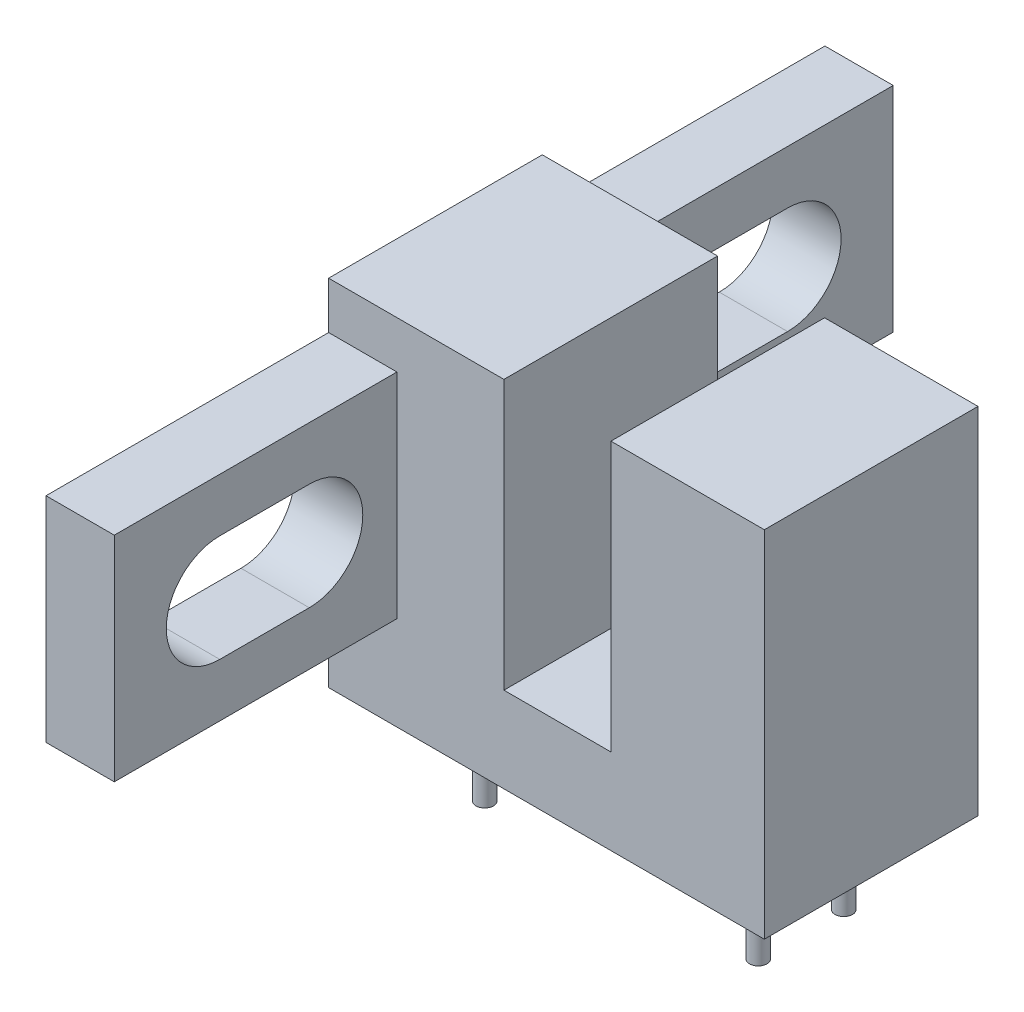
ISO-10303-21;
HEADER;
FILE_DESCRIPTION(('STEP AP214'),'2;1');
FILE_NAME('part.step','',(''),(''),'','','');
FILE_SCHEMA(('AUTOMOTIVE_DESIGN { 1 0 10303 214 1 1 1 1 }'));
ENDSEC;
DATA;
#1=APPLICATION_CONTEXT('core data for automotive mechanical design processes');
#2=APPLICATION_PROTOCOL_DEFINITION('international standard','automotive_design',2000,#1);
#3=PRODUCT_CONTEXT('',#1,'mechanical');
#4=PRODUCT('Part','Part','',(#3));
#5=PRODUCT_RELATED_PRODUCT_CATEGORY('part','',(#4));
#6=PRODUCT_DEFINITION_FORMATION('','',#4);
#7=PRODUCT_DEFINITION_CONTEXT('part definition',#1,'design');
#8=PRODUCT_DEFINITION('design','',#6,#7);
#9=PRODUCT_DEFINITION_SHAPE('','',#8);
#10=(LENGTH_UNIT() NAMED_UNIT(*) SI_UNIT(.MILLI.,.METRE.));
#11=(NAMED_UNIT(*) PLANE_ANGLE_UNIT() SI_UNIT($,.RADIAN.));
#12=(NAMED_UNIT(*) SI_UNIT($,.STERADIAN.) SOLID_ANGLE_UNIT());
#13=UNCERTAINTY_MEASURE_WITH_UNIT(LENGTH_MEASURE(1.E-05),#10,'distance_accuracy_value','');
#14=(GEOMETRIC_REPRESENTATION_CONTEXT(3) GLOBAL_UNCERTAINTY_ASSIGNED_CONTEXT((#13)) GLOBAL_UNIT_ASSIGNED_CONTEXT((#10,
#11,#12)) REPRESENTATION_CONTEXT('',''));
#15=CARTESIAN_POINT('',(0.,0.,0.));
#16=DIRECTION('',(0.,0.,1.));
#17=DIRECTION('',(1.,0.,0.));
#18=AXIS2_PLACEMENT_3D('',#15,#16,#17);
#19=CARTESIAN_POINT('',(-6.475,2.54,3.175));
#20=DIRECTION('',(0.,0.,-1.));
#21=DIRECTION('',(-1.,0.,0.));
#22=AXIS2_PLACEMENT_3D('',#19,#20,#21);
#23=PLANE('',#22);
#24=DIRECTION('',(-1.,0.,0.));
#25=VECTOR('',#24,1.);
#26=CARTESIAN_POINT('',(-4.445,9.14,3.175));
#27=LINE('',#26,#25);
#28=CARTESIAN_POINT('',(-4.445,9.14,3.175));
#29=VERTEX_POINT('',#28);
#30=CARTESIAN_POINT('',(-6.475,9.14,3.175));
#31=VERTEX_POINT('',#30);
#32=EDGE_CURVE('E258',#29,#31,#27,.T.);
#33=ORIENTED_EDGE('',*,*,#32,.F.);
#34=DIRECTION('',(0.,1.,0.));
#35=VECTOR('',#34,1.);
#36=CARTESIAN_POINT('',(-4.445,0.,3.175));
#37=LINE('',#36,#35);
#38=CARTESIAN_POINT('',(-4.445,2.79,3.175));
#39=VERTEX_POINT('',#38);
#40=EDGE_CURVE('E237',#39,#29,#37,.T.);
#41=ORIENTED_EDGE('',*,*,#40,.F.);
#42=DIRECTION('',(-1.,0.,0.));
#43=VECTOR('',#42,1.);
#44=CARTESIAN_POINT('',(-4.445,2.79,3.175));
#45=LINE('',#44,#43);
#46=CARTESIAN_POINT('',(-6.475,2.79,3.175));
#47=VERTEX_POINT('',#46);
#48=EDGE_CURVE('E256',#39,#47,#45,.T.);
#49=ORIENTED_EDGE('',*,*,#48,.T.);
#50=DIRECTION('',(0.,-1.,0.));
#51=VECTOR('',#50,1.);
#52=CARTESIAN_POINT('',(-6.475,2.54,3.175));
#53=LINE('',#52,#51);
#54=CARTESIAN_POINT('',(-6.475,0.,3.175));
#55=VERTEX_POINT('',#54);
#56=EDGE_CURVE('E44',#47,#55,#53,.T.);
#57=ORIENTED_EDGE('',*,*,#56,.T.);
#58=DIRECTION('',(1.,0.,0.));
#59=VECTOR('',#58,1.);
#60=CARTESIAN_POINT('',(-6.475,0.,3.175));
#61=LINE('',#60,#59);
#62=CARTESIAN_POINT('',(6.475,0.,3.175));
#63=VERTEX_POINT('',#62);
#64=EDGE_CURVE('E387',#55,#63,#61,.T.);
#65=ORIENTED_EDGE('',*,*,#64,.T.);
#66=DIRECTION('',(0.,-1.,0.));
#67=VECTOR('',#66,1.);
#68=CARTESIAN_POINT('',(6.475,2.54,3.175));
#69=LINE('',#68,#67);
#70=CARTESIAN_POINT('',(6.475,10.54,3.175));
#71=VERTEX_POINT('',#70);
#72=EDGE_CURVE('E399',#71,#63,#69,.T.);
#73=ORIENTED_EDGE('',*,*,#72,.F.);
#74=DIRECTION('',(-1.,0.,0.));
#75=VECTOR('',#74,1.);
#76=CARTESIAN_POINT('',(6.475,10.54,3.175));
#77=LINE('',#76,#75);
#78=CARTESIAN_POINT('',(1.915,10.54,3.175));
#79=VERTEX_POINT('',#78);
#80=EDGE_CURVE('E358',#71,#79,#77,.T.);
#81=ORIENTED_EDGE('',*,*,#80,.T.);
#82=DIRECTION('',(0.,-1.,0.));
#83=VECTOR('',#82,1.);
#84=CARTESIAN_POINT('',(1.915,10.54,3.175));
#85=LINE('',#84,#83);
#86=CARTESIAN_POINT('',(1.915,2.54,3.175));
#87=VERTEX_POINT('',#86);
#88=EDGE_CURVE('E347',#79,#87,#85,.T.);
#89=ORIENTED_EDGE('',*,*,#88,.T.);
#90=DIRECTION('',(1.,0.,0.));
#91=VECTOR('',#90,1.);
#92=CARTESIAN_POINT('',(-6.475,2.54,3.175));
#93=LINE('',#92,#91);
#94=CARTESIAN_POINT('',(-1.265,2.54,3.175));
#95=VERTEX_POINT('',#94);
#96=EDGE_CURVE('E386',#95,#87,#93,.T.);
#97=ORIENTED_EDGE('',*,*,#96,.F.);
#98=DIRECTION('',(0.,-1.,0.));
#99=VECTOR('',#98,1.);
#100=CARTESIAN_POINT('',(-1.265,10.54,3.175));
#101=LINE('',#100,#99);
#102=CARTESIAN_POINT('',(-1.265,10.54,3.175));
#103=VERTEX_POINT('',#102);
#104=EDGE_CURVE('E379',#103,#95,#101,.T.);
#105=ORIENTED_EDGE('',*,*,#104,.F.);
#106=DIRECTION('',(1.,0.,0.));
#107=VECTOR('',#106,1.);
#108=CARTESIAN_POINT('',(-6.475,10.54,3.175));
#109=LINE('',#108,#107);
#110=CARTESIAN_POINT('',(-6.475,10.54,3.175));
#111=VERTEX_POINT('',#110);
#112=EDGE_CURVE('E371',#111,#103,#109,.T.);
#113=ORIENTED_EDGE('',*,*,#112,.F.);
#114=EDGE_CURVE('E11',#111,#31,#53,.T.);
#115=ORIENTED_EDGE('',*,*,#114,.T.);
#116=EDGE_LOOP('',(#33,#41,#49,#57,#65,#73,#81,#89,#97,#105,#113,#115));
#117=FACE_BOUND('',#116,.T.);
#118=ADVANCED_FACE('F35',(#117),#23,.F.);
#119=CARTESIAN_POINT('',(0.,2.54,0.));
#120=DIRECTION('',(0.,-1.,0.));
#121=DIRECTION('',(0.,0.,-1.));
#122=AXIS2_PLACEMENT_3D('',#119,#120,#121);
#123=PLANE('',#122);
#124=DIRECTION('',(0.,0.,1.));
#125=VECTOR('',#124,1.);
#126=CARTESIAN_POINT('',(1.915,2.54,-3.175));
#127=LINE('',#126,#125);
#128=CARTESIAN_POINT('',(1.915,2.54,-3.175));
#129=VERTEX_POINT('',#128);
#130=EDGE_CURVE('E351',#129,#87,#127,.T.);
#131=ORIENTED_EDGE('',*,*,#130,.F.);
#132=DIRECTION('',(1.,0.,0.));
#133=VECTOR('',#132,1.);
#134=CARTESIAN_POINT('',(-6.475,2.54,-3.175));
#135=LINE('',#134,#133);
#136=CARTESIAN_POINT('',(-1.265,2.54,-3.175));
#137=VERTEX_POINT('',#136);
#138=EDGE_CURVE('E383',#137,#129,#135,.T.);
#139=ORIENTED_EDGE('',*,*,#138,.F.);
#140=DIRECTION('',(0.,0.,1.));
#141=VECTOR('',#140,1.);
#142=CARTESIAN_POINT('',(-1.265,2.54,-3.175));
#143=LINE('',#142,#141);
#144=EDGE_CURVE('E354',#137,#95,#143,.T.);
#145=ORIENTED_EDGE('',*,*,#144,.T.);
#146=ORIENTED_EDGE('',*,*,#96,.T.);
#147=EDGE_LOOP('',(#131,#139,#145,#146));
#148=FACE_BOUND('',#147,.T.);
#149=ADVANCED_FACE('F435',(#148),#123,.F.);
#150=CARTESIAN_POINT('',(-6.475,2.54,3.175));
#151=DIRECTION('',(-1.,0.,0.));
#152=DIRECTION('',(0.,0.,1.));
#153=AXIS2_PLACEMENT_3D('',#150,#151,#152);
#154=PLANE('',#153);
#155=DIRECTION('',(0.,0.,-1.));
#156=VECTOR('',#155,1.);
#157=CARTESIAN_POINT('',(-6.475,0.,3.175));
#158=LINE('',#157,#156);
#159=CARTESIAN_POINT('',(-6.475,0.,-3.175));
#160=VERTEX_POINT('',#159);
#161=EDGE_CURVE('E381',#55,#160,#158,.T.);
#162=ORIENTED_EDGE('',*,*,#161,.F.);
#163=ORIENTED_EDGE('',*,*,#56,.F.);
#164=DIRECTION('',(0.,0.,1.));
#165=VECTOR('',#164,1.);
#166=CARTESIAN_POINT('',(-6.475,2.79,0.));
#167=LINE('',#166,#165);
#168=CARTESIAN_POINT('',(-6.475,2.79,11.575));
#169=VERTEX_POINT('',#168);
#170=EDGE_CURVE('E52',#47,#169,#167,.T.);
#171=ORIENTED_EDGE('',*,*,#170,.T.);
#172=DIRECTION('',(0.,-1.,0.));
#173=VECTOR('',#172,1.);
#174=CARTESIAN_POINT('',(-6.475,0.,11.575));
#175=LINE('',#174,#173);
#176=CARTESIAN_POINT('',(-6.475,9.14,11.575));
#177=VERTEX_POINT('',#176);
#178=EDGE_CURVE('E249',#177,#169,#175,.T.);
#179=ORIENTED_EDGE('',*,*,#178,.F.);
#180=DIRECTION('',(0.,0.,1.));
#181=VECTOR('',#180,1.);
#182=CARTESIAN_POINT('',(-6.475,9.14,0.));
#183=LINE('',#182,#181);
#184=EDGE_CURVE('E227',#31,#177,#183,.T.);
#185=ORIENTED_EDGE('',*,*,#184,.F.);
#186=ORIENTED_EDGE('',*,*,#114,.F.);
#187=DIRECTION('',(0.,0.,1.));
#188=VECTOR('',#187,1.);
#189=CARTESIAN_POINT('',(-6.475,10.54,-3.175));
#190=LINE('',#189,#188);
#191=CARTESIAN_POINT('',(-6.475,10.54,-3.175));
#192=VERTEX_POINT('',#191);
#193=EDGE_CURVE('E373',#192,#111,#190,.T.);
#194=ORIENTED_EDGE('',*,*,#193,.F.);
#195=DIRECTION('',(0.,-1.,0.));
#196=VECTOR('',#195,1.);
#197=CARTESIAN_POINT('',(-6.475,2.54,-3.175));
#198=LINE('',#197,#196);
#199=CARTESIAN_POINT('',(-6.475,9.14,-3.175));
#200=VERTEX_POINT('',#199);
#201=EDGE_CURVE('E39',#192,#200,#198,.T.);
#202=ORIENTED_EDGE('',*,*,#201,.T.);
#203=DIRECTION('',(0.,0.,1.));
#204=VECTOR('',#203,1.);
#205=CARTESIAN_POINT('',(-6.475,9.14,0.));
#206=LINE('',#205,#204);
#207=CARTESIAN_POINT('',(-6.475,9.14,-11.575));
#208=VERTEX_POINT('',#207);
#209=EDGE_CURVE('E60',#208,#200,#206,.T.);
#210=ORIENTED_EDGE('',*,*,#209,.F.);
#211=DIRECTION('',(0.,-1.,0.));
#212=VECTOR('',#211,1.);
#213=CARTESIAN_POINT('',(-6.475,0.,-11.575));
#214=LINE('',#213,#212);
#215=CARTESIAN_POINT('',(-6.475,2.79,-11.575));
#216=VERTEX_POINT('',#215);
#217=EDGE_CURVE('E296',#208,#216,#214,.T.);
#218=ORIENTED_EDGE('',*,*,#217,.T.);
#219=DIRECTION('',(0.,0.,1.));
#220=VECTOR('',#219,1.);
#221=CARTESIAN_POINT('',(-6.475,2.79,0.));
#222=LINE('',#221,#220);
#223=CARTESIAN_POINT('',(-6.475,2.79,-3.175));
#224=VERTEX_POINT('',#223);
#225=EDGE_CURVE('E299',#216,#224,#222,.T.);
#226=ORIENTED_EDGE('',*,*,#225,.T.);
#227=EDGE_CURVE('E389',#224,#160,#198,.T.);
#228=ORIENTED_EDGE('',*,*,#227,.T.);
#229=EDGE_LOOP('',(#162,#163,#171,#179,#185,#186,#194,#202,#210,#218,#226,#228));
#230=FACE_BOUND('',#229,.T.);
#231=CARTESIAN_POINT('',(-6.475,5.965,-5.77614008744886));
#232=DIRECTION('',(-1.,0.,0.));
#233=DIRECTION('',(0.,0.,1.));
#234=AXIS2_PLACEMENT_3D('',#231,#232,#233);
#235=CIRCLE('',#234,1.59);
#236=CARTESIAN_POINT('',(-6.475,4.375,-5.77614008744886));
#237=VERTEX_POINT('',#236);
#238=CARTESIAN_POINT('',(-6.475,7.555,-5.77614008744886));
#239=VERTEX_POINT('',#238);
#240=EDGE_CURVE('E255',#237,#239,#235,.T.);
#241=ORIENTED_EDGE('',*,*,#240,.F.);
#242=DIRECTION('',(0.,0.,1.));
#243=VECTOR('',#242,1.);
#244=CARTESIAN_POINT('',(-6.475,4.37499999999999,0.));
#245=LINE('',#244,#243);
#246=CARTESIAN_POINT('',(-6.475,4.375,-8.43614008744886));
#247=VERTEX_POINT('',#246);
#248=EDGE_CURVE('E289',#247,#237,#245,.T.);
#249=ORIENTED_EDGE('',*,*,#248,.F.);
#250=CARTESIAN_POINT('',(-6.475,5.965,-8.43614008744886));
#251=DIRECTION('',(-1.,0.,0.));
#252=DIRECTION('',(0.,0.,1.));
#253=AXIS2_PLACEMENT_3D('',#250,#251,#252);
#254=CIRCLE('',#253,1.59);
#255=CARTESIAN_POINT('',(-6.475,7.555,-8.43614008744886));
#256=VERTEX_POINT('',#255);
#257=EDGE_CURVE('E291',#256,#247,#254,.T.);
#258=ORIENTED_EDGE('',*,*,#257,.F.);
#259=DIRECTION('',(0.,0.,1.));
#260=VECTOR('',#259,1.);
#261=CARTESIAN_POINT('',(-6.475,7.555,0.));
#262=LINE('',#261,#260);
#263=EDGE_CURVE('E293',#256,#239,#262,.T.);
#264=ORIENTED_EDGE('',*,*,#263,.T.);
#265=EDGE_LOOP('',(#241,#249,#258,#264));
#266=FACE_BOUND('',#265,.T.);
#267=CARTESIAN_POINT('',(-6.475,5.965,8.44));
#268=DIRECTION('',(-1.,0.,0.));
#269=DIRECTION('',(0.,0.,1.));
#270=AXIS2_PLACEMENT_3D('',#267,#268,#269);
#271=CIRCLE('',#270,1.59);
#272=CARTESIAN_POINT('',(-6.475,4.375,8.44));
#273=VERTEX_POINT('',#272);
#274=CARTESIAN_POINT('',(-6.475,7.555,8.44));
#275=VERTEX_POINT('',#274);
#276=EDGE_CURVE('E241',#273,#275,#271,.T.);
#277=ORIENTED_EDGE('',*,*,#276,.F.);
#278=DIRECTION('',(0.,0.,1.));
#279=VECTOR('',#278,1.);
#280=CARTESIAN_POINT('',(-6.475,4.37499999999999,0.));
#281=LINE('',#280,#279);
#282=CARTESIAN_POINT('',(-6.475,4.375,5.78));
#283=VERTEX_POINT('',#282);
#284=EDGE_CURVE('E216',#283,#273,#281,.T.);
#285=ORIENTED_EDGE('',*,*,#284,.F.);
#286=CARTESIAN_POINT('',(-6.475,5.965,5.78));
#287=DIRECTION('',(-1.,0.,0.));
#288=DIRECTION('',(0.,0.,1.));
#289=AXIS2_PLACEMENT_3D('',#286,#287,#288);
#290=CIRCLE('',#289,1.59);
#291=CARTESIAN_POINT('',(-6.475,7.555,5.78));
#292=VERTEX_POINT('',#291);
#293=EDGE_CURVE('E244',#292,#283,#290,.T.);
#294=ORIENTED_EDGE('',*,*,#293,.F.);
#295=DIRECTION('',(0.,0.,1.));
#296=VECTOR('',#295,1.);
#297=CARTESIAN_POINT('',(-6.475,7.555,0.));
#298=LINE('',#297,#296);
#299=EDGE_CURVE('E246',#292,#275,#298,.T.);
#300=ORIENTED_EDGE('',*,*,#299,.T.);
#301=EDGE_LOOP('',(#277,#285,#294,#300));
#302=FACE_BOUND('',#301,.T.);
#303=ADVANCED_FACE('F37',(#230,#266,#302),#154,.T.);
#304=CARTESIAN_POINT('',(6.475,2.54,3.175));
#305=DIRECTION('',(-1.,0.,0.));
#306=DIRECTION('',(0.,0.,1.));
#307=AXIS2_PLACEMENT_3D('',#304,#305,#306);
#308=PLANE('',#307);
#309=DIRECTION('',(0.,0.,-1.));
#310=VECTOR('',#309,1.);
#311=CARTESIAN_POINT('',(6.475,0.,3.175));
#312=LINE('',#311,#310);
#313=CARTESIAN_POINT('',(6.475,0.,-3.175));
#314=VERTEX_POINT('',#313);
#315=EDGE_CURVE('E395',#63,#314,#312,.T.);
#316=ORIENTED_EDGE('',*,*,#315,.T.);
#317=DIRECTION('',(0.,-1.,0.));
#318=VECTOR('',#317,1.);
#319=CARTESIAN_POINT('',(6.475,2.54,-3.175));
#320=LINE('',#319,#318);
#321=CARTESIAN_POINT('',(6.475,10.54,-3.175));
#322=VERTEX_POINT('',#321);
#323=EDGE_CURVE('E401',#322,#314,#320,.T.);
#324=ORIENTED_EDGE('',*,*,#323,.F.);
#325=DIRECTION('',(0.,0.,1.));
#326=VECTOR('',#325,1.);
#327=CARTESIAN_POINT('',(6.475,10.54,-3.175));
#328=LINE('',#327,#326);
#329=EDGE_CURVE('E350',#322,#71,#328,.T.);
#330=ORIENTED_EDGE('',*,*,#329,.T.);
#331=ORIENTED_EDGE('',*,*,#72,.T.);
#332=EDGE_LOOP('',(#316,#324,#330,#331));
#333=FACE_BOUND('',#332,.T.);
#334=ADVANCED_FACE('F423',(#333),#308,.F.);
#335=CARTESIAN_POINT('',(-6.475,2.54,-3.175));
#336=DIRECTION('',(0.,0.,-1.));
#337=DIRECTION('',(-1.,0.,0.));
#338=AXIS2_PLACEMENT_3D('',#335,#336,#337);
#339=PLANE('',#338);
#340=DIRECTION('',(-1.,0.,0.));
#341=VECTOR('',#340,1.);
#342=CARTESIAN_POINT('',(-4.445,2.79,-3.175));
#343=LINE('',#342,#341);
#344=CARTESIAN_POINT('',(-4.445,2.79,-3.175));
#345=VERTEX_POINT('',#344);
#346=EDGE_CURVE('E308',#345,#224,#343,.T.);
#347=ORIENTED_EDGE('',*,*,#346,.F.);
#348=DIRECTION('',(0.,-1.,0.));
#349=VECTOR('',#348,1.);
#350=CARTESIAN_POINT('',(-4.445,0.,-3.175));
#351=LINE('',#350,#349);
#352=CARTESIAN_POINT('',(-4.445,9.14,-3.175));
#353=VERTEX_POINT('',#352);
#354=EDGE_CURVE('E282',#353,#345,#351,.T.);
#355=ORIENTED_EDGE('',*,*,#354,.F.);
#356=DIRECTION('',(-1.,0.,0.));
#357=VECTOR('',#356,1.);
#358=CARTESIAN_POINT('',(-4.445,9.14,-3.175));
#359=LINE('',#358,#357);
#360=EDGE_CURVE('E306',#353,#200,#359,.T.);
#361=ORIENTED_EDGE('',*,*,#360,.T.);
#362=ORIENTED_EDGE('',*,*,#201,.F.);
#363=DIRECTION('',(1.,0.,0.));
#364=VECTOR('',#363,1.);
#365=CARTESIAN_POINT('',(-6.475,10.54,-3.175));
#366=LINE('',#365,#364);
#367=CARTESIAN_POINT('',(-1.265,10.54,-3.175));
#368=VERTEX_POINT('',#367);
#369=EDGE_CURVE('E365',#192,#368,#366,.T.);
#370=ORIENTED_EDGE('',*,*,#369,.T.);
#371=DIRECTION('',(0.,-1.,0.));
#372=VECTOR('',#371,1.);
#373=CARTESIAN_POINT('',(-1.265,10.54,-3.175));
#374=LINE('',#373,#372);
#375=EDGE_CURVE('E376',#368,#137,#374,.T.);
#376=ORIENTED_EDGE('',*,*,#375,.T.);
#377=ORIENTED_EDGE('',*,*,#138,.T.);
#378=DIRECTION('',(0.,-1.,0.));
#379=VECTOR('',#378,1.);
#380=CARTESIAN_POINT('',(1.915,10.54,-3.175));
#381=LINE('',#380,#379);
#382=CARTESIAN_POINT('',(1.915,10.54,-3.175));
#383=VERTEX_POINT('',#382);
#384=EDGE_CURVE('E342',#383,#129,#381,.T.);
#385=ORIENTED_EDGE('',*,*,#384,.F.);
#386=DIRECTION('',(-1.,0.,0.));
#387=VECTOR('',#386,1.);
#388=CARTESIAN_POINT('',(6.475,10.54,-3.175));
#389=LINE('',#388,#387);
#390=EDGE_CURVE('E355',#322,#383,#389,.T.);
#391=ORIENTED_EDGE('',*,*,#390,.F.);
#392=ORIENTED_EDGE('',*,*,#323,.T.);
#393=DIRECTION('',(1.,0.,0.));
#394=VECTOR('',#393,1.);
#395=CARTESIAN_POINT('',(-6.475,0.,-3.175));
#396=LINE('',#395,#394);
#397=EDGE_CURVE('E392',#160,#314,#396,.T.);
#398=ORIENTED_EDGE('',*,*,#397,.F.);
#399=ORIENTED_EDGE('',*,*,#227,.F.);
#400=EDGE_LOOP('',(#347,#355,#361,#362,#370,#376,#377,#385,#391,#392,#398,#399));
#401=FACE_BOUND('',#400,.T.);
#402=ADVANCED_FACE('F414',(#401),#339,.T.);
#403=CARTESIAN_POINT('',(0.,0.,0.));
#404=DIRECTION('',(0.,-1.,0.));
#405=DIRECTION('',(0.,0.,-1.));
#406=AXIS2_PLACEMENT_3D('',#403,#404,#405);
#407=PLANE('',#406);
#408=CARTESIAN_POINT('',(4.39,0.,1.27));
#409=DIRECTION('',(0.,-1.,0.));
#410=DIRECTION('',(0.,0.,-1.));
#411=AXIS2_PLACEMENT_3D('',#408,#409,#410);
#412=CIRCLE('',#411,0.26);
#413=CARTESIAN_POINT('',(4.39,0.,1.01));
#414=VERTEX_POINT('',#413);
#415=EDGE_CURVE('E305',#414,#414,#412,.T.);
#416=ORIENTED_EDGE('',*,*,#415,.F.);
#417=EDGE_LOOP('',(#416));
#418=FACE_BOUND('',#417,.T.);
#419=CARTESIAN_POINT('',(4.39,0.,-1.27));
#420=DIRECTION('',(0.,-1.,0.));
#421=DIRECTION('',(0.,0.,-1.));
#422=AXIS2_PLACEMENT_3D('',#419,#420,#421);
#423=CIRCLE('',#422,0.26);
#424=CARTESIAN_POINT('',(4.39,0.,-1.53));
#425=VERTEX_POINT('',#424);
#426=EDGE_CURVE('E324',#425,#425,#423,.T.);
#427=ORIENTED_EDGE('',*,*,#426,.F.);
#428=EDGE_LOOP('',(#427));
#429=FACE_BOUND('',#428,.T.);
#430=CARTESIAN_POINT('',(-3.74,0.,1.27));
#431=DIRECTION('',(0.,-1.,0.));
#432=DIRECTION('',(0.,0.,-1.));
#433=AXIS2_PLACEMENT_3D('',#430,#431,#432);
#434=CIRCLE('',#433,0.26);
#435=CARTESIAN_POINT('',(-3.74,0.,1.01));
#436=VERTEX_POINT('',#435);
#437=EDGE_CURVE('E330',#436,#436,#434,.T.);
#438=ORIENTED_EDGE('',*,*,#437,.F.);
#439=EDGE_LOOP('',(#438));
#440=FACE_BOUND('',#439,.T.);
#441=CARTESIAN_POINT('',(-3.74,0.,-1.27));
#442=DIRECTION('',(0.,-1.,0.));
#443=DIRECTION('',(0.,0.,-1.));
#444=AXIS2_PLACEMENT_3D('',#441,#442,#443);
#445=CIRCLE('',#444,0.26);
#446=CARTESIAN_POINT('',(-3.74,0.,-1.53));
#447=VERTEX_POINT('',#446);
#448=EDGE_CURVE('E336',#447,#447,#445,.T.);
#449=ORIENTED_EDGE('',*,*,#448,.F.);
#450=EDGE_LOOP('',(#449));
#451=FACE_BOUND('',#450,.T.);
#452=ORIENTED_EDGE('',*,*,#161,.T.);
#453=ORIENTED_EDGE('',*,*,#397,.T.);
#454=ORIENTED_EDGE('',*,*,#315,.F.);
#455=ORIENTED_EDGE('',*,*,#64,.F.);
#456=EDGE_LOOP('',(#452,#453,#454,#455));
#457=FACE_BOUND('',#456,.T.);
#458=ADVANCED_FACE('F418',(#418,#429,#440,#451,#457),#407,.T.);
#459=CARTESIAN_POINT('',(-1.265,10.54,-3.175));
#460=DIRECTION('',(1.,0.,0.));
#461=DIRECTION('',(0.,0.,-1.));
#462=AXIS2_PLACEMENT_3D('',#459,#460,#461);
#463=PLANE('',#462);
#464=ORIENTED_EDGE('',*,*,#144,.F.);
#465=ORIENTED_EDGE('',*,*,#375,.F.);
#466=DIRECTION('',(0.,0.,1.));
#467=VECTOR('',#466,1.);
#468=CARTESIAN_POINT('',(-1.265,10.54,-3.175));
#469=LINE('',#468,#467);
#470=EDGE_CURVE('E368',#368,#103,#469,.T.);
#471=ORIENTED_EDGE('',*,*,#470,.T.);
#472=ORIENTED_EDGE('',*,*,#104,.T.);
#473=EDGE_LOOP('',(#464,#465,#471,#472));
#474=FACE_BOUND('',#473,.T.);
#475=ADVANCED_FACE('F440',(#474),#463,.T.);
#476=CARTESIAN_POINT('',(0.,10.54,0.));
#477=DIRECTION('',(0.,-1.,0.));
#478=DIRECTION('',(0.,0.,-1.));
#479=AXIS2_PLACEMENT_3D('',#476,#477,#478);
#480=PLANE('',#479);
#481=ORIENTED_EDGE('',*,*,#369,.F.);
#482=ORIENTED_EDGE('',*,*,#193,.T.);
#483=ORIENTED_EDGE('',*,*,#112,.T.);
#484=ORIENTED_EDGE('',*,*,#470,.F.);
#485=EDGE_LOOP('',(#481,#482,#483,#484));
#486=FACE_BOUND('',#485,.T.);
#487=ADVANCED_FACE('F443',(#486),#480,.F.);
#488=CARTESIAN_POINT('',(1.915,10.54,-3.175));
#489=DIRECTION('',(1.,0.,0.));
#490=DIRECTION('',(0.,0.,-1.));
#491=AXIS2_PLACEMENT_3D('',#488,#489,#490);
#492=PLANE('',#491);
#493=ORIENTED_EDGE('',*,*,#130,.T.);
#494=ORIENTED_EDGE('',*,*,#88,.F.);
#495=DIRECTION('',(0.,0.,1.));
#496=VECTOR('',#495,1.);
#497=CARTESIAN_POINT('',(1.915,10.54,-3.175));
#498=LINE('',#497,#496);
#499=EDGE_CURVE('E361',#383,#79,#498,.T.);
#500=ORIENTED_EDGE('',*,*,#499,.F.);
#501=ORIENTED_EDGE('',*,*,#384,.T.);
#502=EDGE_LOOP('',(#493,#494,#500,#501));
#503=FACE_BOUND('',#502,.T.);
#504=ADVANCED_FACE('F432',(#503),#492,.F.);
#505=CARTESIAN_POINT('',(0.,10.54,0.));
#506=DIRECTION('',(0.,1.,0.));
#507=DIRECTION('',(0.,0.,1.));
#508=AXIS2_PLACEMENT_3D('',#505,#506,#507);
#509=PLANE('',#508);
#510=ORIENTED_EDGE('',*,*,#390,.T.);
#511=ORIENTED_EDGE('',*,*,#499,.T.);
#512=ORIENTED_EDGE('',*,*,#80,.F.);
#513=ORIENTED_EDGE('',*,*,#329,.F.);
#514=EDGE_LOOP('',(#510,#511,#512,#513));
#515=FACE_BOUND('',#514,.T.);
#516=ADVANCED_FACE('F426',(#515),#509,.T.);
#517=CARTESIAN_POINT('',(-3.74,-2.5,-1.27));
#518=DIRECTION('',(0.,1.,0.));
#519=DIRECTION('',(0.,0.,1.));
#520=AXIS2_PLACEMENT_3D('',#517,#518,#519);
#521=CYLINDRICAL_SURFACE('',#520,0.26);
#522=CARTESIAN_POINT('',(-3.74,-2.5,-1.27));
#523=DIRECTION('',(0.,-1.,0.));
#524=DIRECTION('',(0.,0.,-1.));
#525=AXIS2_PLACEMENT_3D('',#522,#523,#524);
#526=CIRCLE('',#525,0.26);
#527=CARTESIAN_POINT('',(-3.74,-2.5,-1.53));
#528=VERTEX_POINT('',#527);
#529=EDGE_CURVE('E339',#528,#528,#526,.T.);
#530=ORIENTED_EDGE('',*,*,#529,.F.);
#531=EDGE_LOOP('',(#530));
#532=FACE_BOUND('',#531,.T.);
#533=ORIENTED_EDGE('',*,*,#448,.T.);
#534=EDGE_LOOP('',(#533));
#535=FACE_BOUND('',#534,.T.);
#536=ADVANCED_FACE('F495',(#532,#535),#521,.T.);
#537=CARTESIAN_POINT('',(-3.74,-2.5,-1.27));
#538=DIRECTION('',(0.,-1.,0.));
#539=DIRECTION('',(0.,0.,-1.));
#540=AXIS2_PLACEMENT_3D('',#537,#538,#539);
#541=PLANE('',#540);
#542=ORIENTED_EDGE('',*,*,#529,.T.);
#543=EDGE_LOOP('',(#542));
#544=FACE_BOUND('',#543,.T.);
#545=ADVANCED_FACE('F497',(#544),#541,.T.);
#546=CARTESIAN_POINT('',(-3.74,-2.5,1.27));
#547=DIRECTION('',(0.,1.,0.));
#548=DIRECTION('',(0.,0.,1.));
#549=AXIS2_PLACEMENT_3D('',#546,#547,#548);
#550=CYLINDRICAL_SURFACE('',#549,0.26);
#551=CARTESIAN_POINT('',(-3.74,-2.5,1.27));
#552=DIRECTION('',(0.,-1.,0.));
#553=DIRECTION('',(0.,0.,-1.));
#554=AXIS2_PLACEMENT_3D('',#551,#552,#553);
#555=CIRCLE('',#554,0.26);
#556=CARTESIAN_POINT('',(-3.74,-2.5,1.01));
#557=VERTEX_POINT('',#556);
#558=EDGE_CURVE('E333',#557,#557,#555,.T.);
#559=ORIENTED_EDGE('',*,*,#558,.F.);
#560=EDGE_LOOP('',(#559));
#561=FACE_BOUND('',#560,.T.);
#562=ORIENTED_EDGE('',*,*,#437,.T.);
#563=EDGE_LOOP('',(#562));
#564=FACE_BOUND('',#563,.T.);
#565=ADVANCED_FACE('F504',(#561,#564),#550,.T.);
#566=CARTESIAN_POINT('',(-3.74,-2.5,1.27));
#567=DIRECTION('',(0.,-1.,0.));
#568=DIRECTION('',(0.,0.,-1.));
#569=AXIS2_PLACEMENT_3D('',#566,#567,#568);
#570=PLANE('',#569);
#571=ORIENTED_EDGE('',*,*,#558,.T.);
#572=EDGE_LOOP('',(#571));
#573=FACE_BOUND('',#572,.T.);
#574=ADVANCED_FACE('F559',(#573),#570,.T.);
#575=CARTESIAN_POINT('',(4.39,-2.5,-1.27));
#576=DIRECTION('',(0.,1.,0.));
#577=DIRECTION('',(0.,0.,1.));
#578=AXIS2_PLACEMENT_3D('',#575,#576,#577);
#579=CYLINDRICAL_SURFACE('',#578,0.26);
#580=CARTESIAN_POINT('',(4.39,-2.5,-1.27));
#581=DIRECTION('',(0.,-1.,0.));
#582=DIRECTION('',(0.,0.,-1.));
#583=AXIS2_PLACEMENT_3D('',#580,#581,#582);
#584=CIRCLE('',#583,0.26);
#585=CARTESIAN_POINT('',(4.39,-2.5,-1.53));
#586=VERTEX_POINT('',#585);
#587=EDGE_CURVE('E327',#586,#586,#584,.T.);
#588=ORIENTED_EDGE('',*,*,#587,.F.);
#589=EDGE_LOOP('',(#588));
#590=FACE_BOUND('',#589,.T.);
#591=ORIENTED_EDGE('',*,*,#426,.T.);
#592=EDGE_LOOP('',(#591));
#593=FACE_BOUND('',#592,.T.);
#594=ADVANCED_FACE('F569',(#590,#593),#579,.T.);
#595=CARTESIAN_POINT('',(4.39,-2.5,-1.27));
#596=DIRECTION('',(0.,-1.,0.));
#597=DIRECTION('',(0.,0.,-1.));
#598=AXIS2_PLACEMENT_3D('',#595,#596,#597);
#599=PLANE('',#598);
#600=ORIENTED_EDGE('',*,*,#587,.T.);
#601=EDGE_LOOP('',(#600));
#602=FACE_BOUND('',#601,.T.);
#603=ADVANCED_FACE('F580',(#602),#599,.T.);
#604=CARTESIAN_POINT('',(4.39,-2.5,1.27));
#605=DIRECTION('',(0.,1.,0.));
#606=DIRECTION('',(0.,0.,1.));
#607=AXIS2_PLACEMENT_3D('',#604,#605,#606);
#608=CYLINDRICAL_SURFACE('',#607,0.26);
#609=CARTESIAN_POINT('',(4.39,-2.5,1.27));
#610=DIRECTION('',(0.,-1.,0.));
#611=DIRECTION('',(0.,0.,-1.));
#612=AXIS2_PLACEMENT_3D('',#609,#610,#611);
#613=CIRCLE('',#612,0.26);
#614=CARTESIAN_POINT('',(4.39,-2.5,1.01));
#615=VERTEX_POINT('',#614);
#616=EDGE_CURVE('E321',#615,#615,#613,.T.);
#617=ORIENTED_EDGE('',*,*,#616,.F.);
#618=EDGE_LOOP('',(#617));
#619=FACE_BOUND('',#618,.T.);
#620=ORIENTED_EDGE('',*,*,#415,.T.);
#621=EDGE_LOOP('',(#620));
#622=FACE_BOUND('',#621,.T.);
#623=ADVANCED_FACE('F592',(#619,#622),#608,.T.);
#624=CARTESIAN_POINT('',(4.39,-2.5,1.27));
#625=DIRECTION('',(0.,-1.,0.));
#626=DIRECTION('',(0.,0.,-1.));
#627=AXIS2_PLACEMENT_3D('',#624,#625,#626);
#628=PLANE('',#627);
#629=ORIENTED_EDGE('',*,*,#616,.T.);
#630=EDGE_LOOP('',(#629));
#631=FACE_BOUND('',#630,.T.);
#632=ADVANCED_FACE('F603',(#631),#628,.T.);
#633=CARTESIAN_POINT('',(-4.445,0.,-11.575));
#634=DIRECTION('',(0.,0.,-1.));
#635=DIRECTION('',(-1.,0.,0.));
#636=AXIS2_PLACEMENT_3D('',#633,#634,#635);
#637=PLANE('',#636);
#638=ORIENTED_EDGE('',*,*,#217,.F.);
#639=DIRECTION('',(-1.,0.,0.));
#640=VECTOR('',#639,1.);
#641=CARTESIAN_POINT('',(-4.445,9.14,-11.575));
#642=LINE('',#641,#640);
#643=CARTESIAN_POINT('',(-4.445,9.14,-11.575));
#644=VERTEX_POINT('',#643);
#645=EDGE_CURVE('E303',#644,#208,#642,.T.);
#646=ORIENTED_EDGE('',*,*,#645,.F.);
#647=DIRECTION('',(0.,-1.,0.));
#648=VECTOR('',#647,1.);
#649=CARTESIAN_POINT('',(-4.445,0.,-11.575));
#650=LINE('',#649,#648);
#651=CARTESIAN_POINT('',(-4.445,2.79,-11.575));
#652=VERTEX_POINT('',#651);
#653=EDGE_CURVE('E276',#644,#652,#650,.T.);
#654=ORIENTED_EDGE('',*,*,#653,.T.);
#655=DIRECTION('',(-1.,0.,0.));
#656=VECTOR('',#655,1.);
#657=CARTESIAN_POINT('',(-4.445,2.79,-11.575));
#658=LINE('',#657,#656);
#659=EDGE_CURVE('E310',#652,#216,#658,.T.);
#660=ORIENTED_EDGE('',*,*,#659,.T.);
#661=EDGE_LOOP('',(#638,#646,#654,#660));
#662=FACE_BOUND('',#661,.T.);
#663=ADVANCED_FACE('F614',(#662),#637,.T.);
#664=CARTESIAN_POINT('',(-4.445,9.14,0.));
#665=DIRECTION('',(0.,-1.,0.));
#666=DIRECTION('',(0.,0.,-1.));
#667=AXIS2_PLACEMENT_3D('',#664,#665,#666);
#668=PLANE('',#667);
#669=ORIENTED_EDGE('',*,*,#209,.T.);
#670=ORIENTED_EDGE('',*,*,#360,.F.);
#671=DIRECTION('',(0.,0.,1.));
#672=VECTOR('',#671,1.);
#673=CARTESIAN_POINT('',(-4.445,9.14,0.));
#674=LINE('',#673,#672);
#675=EDGE_CURVE('E284',#644,#353,#674,.T.);
#676=ORIENTED_EDGE('',*,*,#675,.F.);
#677=ORIENTED_EDGE('',*,*,#645,.T.);
#678=EDGE_LOOP('',(#669,#670,#676,#677));
#679=FACE_BOUND('',#678,.T.);
#680=ADVANCED_FACE('F650',(#679),#668,.F.);
#681=CARTESIAN_POINT('',(-4.445,5.965,-5.77614008744886));
#682=DIRECTION('',(-1.,0.,0.));
#683=DIRECTION('',(0.,0.,1.));
#684=AXIS2_PLACEMENT_3D('',#681,#682,#683);
#685=CYLINDRICAL_SURFACE('',#684,1.59);
#686=ORIENTED_EDGE('',*,*,#240,.T.);
#687=DIRECTION('',(-1.,0.,0.));
#688=VECTOR('',#687,1.);
#689=CARTESIAN_POINT('',(-4.445,7.555,-5.77614008744886));
#690=LINE('',#689,#688);
#691=CARTESIAN_POINT('',(-4.445,7.555,-5.77614008744886));
#692=VERTEX_POINT('',#691);
#693=EDGE_CURVE('E312',#692,#239,#690,.T.);
#694=ORIENTED_EDGE('',*,*,#693,.F.);
#695=CARTESIAN_POINT('',(-4.445,5.965,-5.77614008744886));
#696=DIRECTION('',(-1.,0.,0.));
#697=DIRECTION('',(0.,0.,1.));
#698=AXIS2_PLACEMENT_3D('',#695,#696,#697);
#699=CIRCLE('',#698,1.59);
#700=CARTESIAN_POINT('',(-4.445,4.375,-5.77614008744886));
#701=VERTEX_POINT('',#700);
#702=EDGE_CURVE('E267',#701,#692,#699,.T.);
#703=ORIENTED_EDGE('',*,*,#702,.F.);
#704=DIRECTION('',(-1.,0.,0.));
#705=VECTOR('',#704,1.);
#706=CARTESIAN_POINT('',(-4.445,4.375,-5.77614008744886));
#707=LINE('',#706,#705);
#708=EDGE_CURVE('E286',#701,#237,#707,.T.);
#709=ORIENTED_EDGE('',*,*,#708,.T.);
#710=EDGE_LOOP('',(#686,#694,#703,#709));
#711=FACE_BOUND('',#710,.T.);
#712=ADVANCED_FACE('F662',(#711),#685,.F.);
#713=CARTESIAN_POINT('',(-4.445,7.555,0.));
#714=DIRECTION('',(0.,-1.,0.));
#715=DIRECTION('',(0.,0.,-1.));
#716=AXIS2_PLACEMENT_3D('',#713,#714,#715);
#717=PLANE('',#716);
#718=ORIENTED_EDGE('',*,*,#263,.F.);
#719=DIRECTION('',(-1.,0.,0.));
#720=VECTOR('',#719,1.);
#721=CARTESIAN_POINT('',(-4.445,7.555,-8.43614008744886));
#722=LINE('',#721,#720);
#723=CARTESIAN_POINT('',(-4.445,7.555,-8.43614008744886));
#724=VERTEX_POINT('',#723);
#725=EDGE_CURVE('E314',#724,#256,#722,.T.);
#726=ORIENTED_EDGE('',*,*,#725,.F.);
#727=DIRECTION('',(0.,0.,1.));
#728=VECTOR('',#727,1.);
#729=CARTESIAN_POINT('',(-4.445,7.555,0.));
#730=LINE('',#729,#728);
#731=EDGE_CURVE('E273',#724,#692,#730,.T.);
#732=ORIENTED_EDGE('',*,*,#731,.T.);
#733=ORIENTED_EDGE('',*,*,#693,.T.);
#734=EDGE_LOOP('',(#718,#726,#732,#733));
#735=FACE_BOUND('',#734,.T.);
#736=ADVANCED_FACE('F673',(#735),#717,.T.);
#737=CARTESIAN_POINT('',(-4.445,5.965,-8.43614008744886));
#738=DIRECTION('',(-1.,0.,0.));
#739=DIRECTION('',(0.,0.,1.));
#740=AXIS2_PLACEMENT_3D('',#737,#738,#739);
#741=CYLINDRICAL_SURFACE('',#740,1.59);
#742=ORIENTED_EDGE('',*,*,#257,.T.);
#743=DIRECTION('',(-1.,0.,0.));
#744=VECTOR('',#743,1.);
#745=CARTESIAN_POINT('',(-4.445,4.375,-8.43614008744886));
#746=LINE('',#745,#744);
#747=CARTESIAN_POINT('',(-4.445,4.375,-8.43614008744886));
#748=VERTEX_POINT('',#747);
#749=EDGE_CURVE('E316',#748,#247,#746,.T.);
#750=ORIENTED_EDGE('',*,*,#749,.F.);
#751=CARTESIAN_POINT('',(-4.445,5.965,-8.43614008744886));
#752=DIRECTION('',(-1.,0.,0.));
#753=DIRECTION('',(0.,0.,1.));
#754=AXIS2_PLACEMENT_3D('',#751,#752,#753);
#755=CIRCLE('',#754,1.59);
#756=EDGE_CURVE('E271',#724,#748,#755,.T.);
#757=ORIENTED_EDGE('',*,*,#756,.F.);
#758=ORIENTED_EDGE('',*,*,#725,.T.);
#759=EDGE_LOOP('',(#742,#750,#757,#758));
#760=FACE_BOUND('',#759,.T.);
#761=ADVANCED_FACE('F685',(#760),#741,.F.);
#762=CARTESIAN_POINT('',(-4.445,4.37499999999999,0.));
#763=DIRECTION('',(0.,-1.,0.));
#764=DIRECTION('',(0.,0.,-1.));
#765=AXIS2_PLACEMENT_3D('',#762,#763,#764);
#766=PLANE('',#765);
#767=ORIENTED_EDGE('',*,*,#248,.T.);
#768=ORIENTED_EDGE('',*,*,#708,.F.);
#769=DIRECTION('',(0.,0.,1.));
#770=VECTOR('',#769,1.);
#771=CARTESIAN_POINT('',(-4.445,4.37499999999999,0.));
#772=LINE('',#771,#770);
#773=EDGE_CURVE('E269',#748,#701,#772,.T.);
#774=ORIENTED_EDGE('',*,*,#773,.F.);
#775=ORIENTED_EDGE('',*,*,#749,.T.);
#776=EDGE_LOOP('',(#767,#768,#774,#775));
#777=FACE_BOUND('',#776,.T.);
#778=ADVANCED_FACE('F696',(#777),#766,.F.);
#779=CARTESIAN_POINT('',(-4.445,2.79,0.));
#780=DIRECTION('',(0.,-1.,0.));
#781=DIRECTION('',(0.,0.,-1.));
#782=AXIS2_PLACEMENT_3D('',#779,#780,#781);
#783=PLANE('',#782);
#784=ORIENTED_EDGE('',*,*,#225,.F.);
#785=ORIENTED_EDGE('',*,*,#659,.F.);
#786=DIRECTION('',(0.,0.,1.));
#787=VECTOR('',#786,1.);
#788=CARTESIAN_POINT('',(-4.445,2.79,0.));
#789=LINE('',#788,#787);
#790=EDGE_CURVE('E279',#652,#345,#789,.T.);
#791=ORIENTED_EDGE('',*,*,#790,.T.);
#792=ORIENTED_EDGE('',*,*,#346,.T.);
#793=EDGE_LOOP('',(#784,#785,#791,#792));
#794=FACE_BOUND('',#793,.T.);
#795=ADVANCED_FACE('F707',(#794),#783,.T.);
#796=CARTESIAN_POINT('',(-4.445,0.,0.));
#797=DIRECTION('',(-1.,0.,0.));
#798=DIRECTION('',(0.,0.,1.));
#799=AXIS2_PLACEMENT_3D('',#796,#797,#798);
#800=PLANE('',#799);
#801=ORIENTED_EDGE('',*,*,#702,.T.);
#802=ORIENTED_EDGE('',*,*,#731,.F.);
#803=ORIENTED_EDGE('',*,*,#756,.T.);
#804=ORIENTED_EDGE('',*,*,#773,.T.);
#805=EDGE_LOOP('',(#801,#802,#803,#804));
#806=FACE_BOUND('',#805,.T.);
#807=ORIENTED_EDGE('',*,*,#653,.F.);
#808=ORIENTED_EDGE('',*,*,#675,.T.);
#809=ORIENTED_EDGE('',*,*,#354,.T.);
#810=ORIENTED_EDGE('',*,*,#790,.F.);
#811=EDGE_LOOP('',(#807,#808,#809,#810));
#812=FACE_BOUND('',#811,.T.);
#813=ADVANCED_FACE('F465',(#806,#812),#800,.F.);
#814=CARTESIAN_POINT('',(-4.445,0.,11.575));
#815=DIRECTION('',(0.,0.,-1.));
#816=DIRECTION('',(-1.,0.,0.));
#817=AXIS2_PLACEMENT_3D('',#814,#815,#816);
#818=PLANE('',#817);
#819=ORIENTED_EDGE('',*,*,#178,.T.);
#820=DIRECTION('',(-1.,0.,0.));
#821=VECTOR('',#820,1.);
#822=CARTESIAN_POINT('',(-4.445,2.79,11.575));
#823=LINE('',#822,#821);
#824=CARTESIAN_POINT('',(-4.445,2.79,11.575));
#825=VERTEX_POINT('',#824);
#826=EDGE_CURVE('E253',#825,#169,#823,.T.);
#827=ORIENTED_EDGE('',*,*,#826,.F.);
#828=DIRECTION('',(0.,-1.,0.));
#829=VECTOR('',#828,1.);
#830=CARTESIAN_POINT('',(-4.445,0.,11.575));
#831=LINE('',#830,#829);
#832=CARTESIAN_POINT('',(-4.445,9.14,11.575));
#833=VERTEX_POINT('',#832);
#834=EDGE_CURVE('E233',#833,#825,#831,.T.);
#835=ORIENTED_EDGE('',*,*,#834,.F.);
#836=DIRECTION('',(-1.,0.,0.));
#837=VECTOR('',#836,1.);
#838=CARTESIAN_POINT('',(-4.445,9.14,11.575));
#839=LINE('',#838,#837);
#840=EDGE_CURVE('E260',#833,#177,#839,.T.);
#841=ORIENTED_EDGE('',*,*,#840,.T.);
#842=EDGE_LOOP('',(#819,#827,#835,#841));
#843=FACE_BOUND('',#842,.T.);
#844=ADVANCED_FACE('F452',(#843),#818,.F.);
#845=CARTESIAN_POINT('',(-4.445,2.79,0.));
#846=DIRECTION('',(0.,-1.,0.));
#847=DIRECTION('',(0.,0.,-1.));
#848=AXIS2_PLACEMENT_3D('',#845,#846,#847);
#849=PLANE('',#848);
#850=ORIENTED_EDGE('',*,*,#170,.F.);
#851=ORIENTED_EDGE('',*,*,#48,.F.);
#852=DIRECTION('',(0.,0.,1.));
#853=VECTOR('',#852,1.);
#854=CARTESIAN_POINT('',(-4.445,2.79,0.));
#855=LINE('',#854,#853);
#856=EDGE_CURVE('E221',#39,#825,#855,.T.);
#857=ORIENTED_EDGE('',*,*,#856,.T.);
#858=ORIENTED_EDGE('',*,*,#826,.T.);
#859=EDGE_LOOP('',(#850,#851,#857,#858));
#860=FACE_BOUND('',#859,.T.);
#861=ADVANCED_FACE('F456',(#860),#849,.T.);
#862=CARTESIAN_POINT('',(-4.445,5.965,8.44));
#863=DIRECTION('',(-1.,0.,0.));
#864=DIRECTION('',(0.,0.,1.));
#865=AXIS2_PLACEMENT_3D('',#862,#863,#864);
#866=CYLINDRICAL_SURFACE('',#865,1.59);
#867=ORIENTED_EDGE('',*,*,#276,.T.);
#868=DIRECTION('',(-1.,0.,0.));
#869=VECTOR('',#868,1.);
#870=CARTESIAN_POINT('',(-4.445,7.555,8.44));
#871=LINE('',#870,#869);
#872=CARTESIAN_POINT('',(-4.445,7.555,8.44));
#873=VERTEX_POINT('',#872);
#874=EDGE_CURVE('E224',#873,#275,#871,.T.);
#875=ORIENTED_EDGE('',*,*,#874,.F.);
#876=CARTESIAN_POINT('',(-4.445,5.965,8.44));
#877=DIRECTION('',(-1.,0.,0.));
#878=DIRECTION('',(0.,0.,1.));
#879=AXIS2_PLACEMENT_3D('',#876,#877,#878);
#880=CIRCLE('',#879,1.59);
#881=CARTESIAN_POINT('',(-4.445,4.375,8.44));
#882=VERTEX_POINT('',#881);
#883=EDGE_CURVE('E204',#882,#873,#880,.T.);
#884=ORIENTED_EDGE('',*,*,#883,.F.);
#885=DIRECTION('',(-1.,0.,0.));
#886=VECTOR('',#885,1.);
#887=CARTESIAN_POINT('',(-4.445,4.375,8.44));
#888=LINE('',#887,#886);
#889=EDGE_CURVE('E213',#882,#273,#888,.T.);
#890=ORIENTED_EDGE('',*,*,#889,.T.);
#891=EDGE_LOOP('',(#867,#875,#884,#890));
#892=FACE_BOUND('',#891,.T.);
#893=ADVANCED_FACE('F223',(#892),#866,.F.);
#894=CARTESIAN_POINT('',(-4.445,7.555,0.));
#895=DIRECTION('',(0.,-1.,0.));
#896=DIRECTION('',(0.,0.,-1.));
#897=AXIS2_PLACEMENT_3D('',#894,#895,#896);
#898=PLANE('',#897);
#899=ORIENTED_EDGE('',*,*,#299,.F.);
#900=DIRECTION('',(-1.,0.,0.));
#901=VECTOR('',#900,1.);
#902=CARTESIAN_POINT('',(-4.445,7.555,5.78));
#903=LINE('',#902,#901);
#904=CARTESIAN_POINT('',(-4.445,7.555,5.78));
#905=VERTEX_POINT('',#904);
#906=EDGE_CURVE('E264',#905,#292,#903,.T.);
#907=ORIENTED_EDGE('',*,*,#906,.F.);
#908=DIRECTION('',(0.,0.,1.));
#909=VECTOR('',#908,1.);
#910=CARTESIAN_POINT('',(-4.445,7.555,0.));
#911=LINE('',#910,#909);
#912=EDGE_CURVE('E231',#905,#873,#911,.T.);
#913=ORIENTED_EDGE('',*,*,#912,.T.);
#914=ORIENTED_EDGE('',*,*,#874,.T.);
#915=EDGE_LOOP('',(#899,#907,#913,#914));
#916=FACE_BOUND('',#915,.T.);
#917=ADVANCED_FACE('F463',(#916),#898,.T.);
#918=CARTESIAN_POINT('',(-4.445,5.965,5.78));
#919=DIRECTION('',(-1.,0.,0.));
#920=DIRECTION('',(0.,0.,1.));
#921=AXIS2_PLACEMENT_3D('',#918,#919,#920);
#922=CYLINDRICAL_SURFACE('',#921,1.59);
#923=ORIENTED_EDGE('',*,*,#293,.T.);
#924=DIRECTION('',(-1.,0.,0.));
#925=VECTOR('',#924,1.);
#926=CARTESIAN_POINT('',(-4.445,4.375,5.78));
#927=LINE('',#926,#925);
#928=CARTESIAN_POINT('',(-4.445,4.375,5.78));
#929=VERTEX_POINT('',#928);
#930=EDGE_CURVE('E220',#929,#283,#927,.T.);
#931=ORIENTED_EDGE('',*,*,#930,.F.);
#932=CARTESIAN_POINT('',(-4.445,5.965,5.78));
#933=DIRECTION('',(-1.,0.,0.));
#934=DIRECTION('',(0.,0.,1.));
#935=AXIS2_PLACEMENT_3D('',#932,#933,#934);
#936=CIRCLE('',#935,1.59);
#937=EDGE_CURVE('E207',#905,#929,#936,.T.);
#938=ORIENTED_EDGE('',*,*,#937,.F.);
#939=ORIENTED_EDGE('',*,*,#906,.T.);
#940=EDGE_LOOP('',(#923,#931,#938,#939));
#941=FACE_BOUND('',#940,.T.);
#942=ADVANCED_FACE('F758',(#941),#922,.F.);
#943=CARTESIAN_POINT('',(-4.445,4.37499999999999,0.));
#944=DIRECTION('',(0.,-1.,0.));
#945=DIRECTION('',(0.,0.,-1.));
#946=AXIS2_PLACEMENT_3D('',#943,#944,#945);
#947=PLANE('',#946);
#948=ORIENTED_EDGE('',*,*,#284,.T.);
#949=ORIENTED_EDGE('',*,*,#889,.F.);
#950=DIRECTION('',(0.,0.,1.));
#951=VECTOR('',#950,1.);
#952=CARTESIAN_POINT('',(-4.445,4.37499999999999,0.));
#953=LINE('',#952,#951);
#954=EDGE_CURVE('E198',#929,#882,#953,.T.);
#955=ORIENTED_EDGE('',*,*,#954,.F.);
#956=ORIENTED_EDGE('',*,*,#930,.T.);
#957=EDGE_LOOP('',(#948,#949,#955,#956));
#958=FACE_BOUND('',#957,.T.);
#959=ADVANCED_FACE('F214',(#958),#947,.F.);
#960=CARTESIAN_POINT('',(-4.445,9.14,0.));
#961=DIRECTION('',(0.,-1.,0.));
#962=DIRECTION('',(0.,0.,-1.));
#963=AXIS2_PLACEMENT_3D('',#960,#961,#962);
#964=PLANE('',#963);
#965=ORIENTED_EDGE('',*,*,#184,.T.);
#966=ORIENTED_EDGE('',*,*,#840,.F.);
#967=DIRECTION('',(0.,0.,1.));
#968=VECTOR('',#967,1.);
#969=CARTESIAN_POINT('',(-4.445,9.14,0.));
#970=LINE('',#969,#968);
#971=EDGE_CURVE('E235',#29,#833,#970,.T.);
#972=ORIENTED_EDGE('',*,*,#971,.F.);
#973=ORIENTED_EDGE('',*,*,#32,.T.);
#974=EDGE_LOOP('',(#965,#966,#972,#973));
#975=FACE_BOUND('',#974,.T.);
#976=ADVANCED_FACE('F448',(#975),#964,.F.);
#977=CARTESIAN_POINT('',(-4.445,0.,0.));
#978=DIRECTION('',(-1.,0.,0.));
#979=DIRECTION('',(0.,0.,1.));
#980=AXIS2_PLACEMENT_3D('',#977,#978,#979);
#981=PLANE('',#980);
#982=ORIENTED_EDGE('',*,*,#883,.T.);
#983=ORIENTED_EDGE('',*,*,#912,.F.);
#984=ORIENTED_EDGE('',*,*,#937,.T.);
#985=ORIENTED_EDGE('',*,*,#954,.T.);
#986=EDGE_LOOP('',(#982,#983,#984,#985));
#987=FACE_BOUND('',#986,.T.);
#988=ORIENTED_EDGE('',*,*,#834,.T.);
#989=ORIENTED_EDGE('',*,*,#856,.F.);
#990=ORIENTED_EDGE('',*,*,#40,.T.);
#991=ORIENTED_EDGE('',*,*,#971,.T.);
#992=EDGE_LOOP('',(#988,#989,#990,#991));
#993=FACE_BOUND('',#992,.T.);
#994=ADVANCED_FACE('F200',(#987,#993),#981,.F.);
#995=CLOSED_SHELL('',(#118,#149,#303,#334,#402,#458,#475,#487,#504,#516,#536,#545,#565,#574,
#594,#603,#623,#632,#663,#680,#712,#736,#761,#778,#795,#813,#844,#861,#893,#917,#942,#959,#976,#994));
#996=MANIFOLD_SOLID_BREP('B2',#995);
#997=ADVANCED_BREP_SHAPE_REPRESENTATION('',(#18,#996),#14);
#998=SHAPE_DEFINITION_REPRESENTATION(#9,#997);
ENDSEC;
END-ISO-10303-21;
